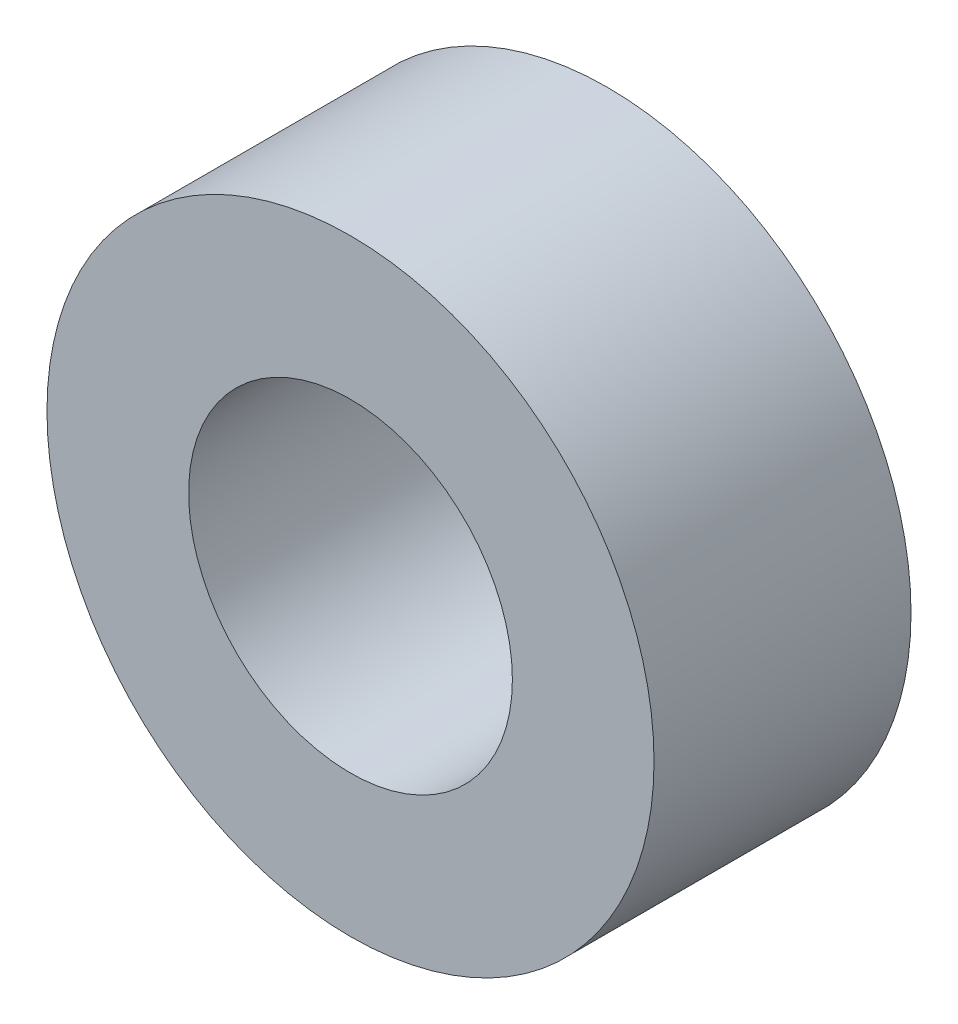
ISO-10303-21;
HEADER;
FILE_DESCRIPTION(('STEP AP214'),'2;1');
FILE_NAME('part.step','',(''),(''),'','','');
FILE_SCHEMA(('AUTOMOTIVE_DESIGN { 1 0 10303 214 1 1 1 1 }'));
ENDSEC;
DATA;
#1=APPLICATION_CONTEXT('core data for automotive mechanical design processes');
#2=APPLICATION_PROTOCOL_DEFINITION('international standard','automotive_design',2000,#1);
#3=PRODUCT_CONTEXT('',#1,'mechanical');
#4=PRODUCT('Part','Part','',(#3));
#5=PRODUCT_RELATED_PRODUCT_CATEGORY('part','',(#4));
#6=PRODUCT_DEFINITION_FORMATION('','',#4);
#7=PRODUCT_DEFINITION_CONTEXT('part definition',#1,'design');
#8=PRODUCT_DEFINITION('design','',#6,#7);
#9=PRODUCT_DEFINITION_SHAPE('','',#8);
#10=(LENGTH_UNIT() NAMED_UNIT(*) SI_UNIT(.MILLI.,.METRE.));
#11=(NAMED_UNIT(*) PLANE_ANGLE_UNIT() SI_UNIT($,.RADIAN.));
#12=(NAMED_UNIT(*) SI_UNIT($,.STERADIAN.) SOLID_ANGLE_UNIT());
#13=UNCERTAINTY_MEASURE_WITH_UNIT(LENGTH_MEASURE(1.E-05),#10,'distance_accuracy_value','');
#14=(GEOMETRIC_REPRESENTATION_CONTEXT(3) GLOBAL_UNCERTAINTY_ASSIGNED_CONTEXT((#13)) GLOBAL_UNIT_ASSIGNED_CONTEXT((#10,
#11,#12)) REPRESENTATION_CONTEXT('',''));
#15=CARTESIAN_POINT('',(0.,0.,0.));
#16=DIRECTION('',(0.,0.,1.));
#17=DIRECTION('',(1.,0.,0.));
#18=AXIS2_PLACEMENT_3D('',#15,#16,#17);
#19=CARTESIAN_POINT('',(0.,0.,3.175));
#20=DIRECTION('',(0.,0.,1.));
#21=DIRECTION('',(1.,0.,0.));
#22=AXIS2_PLACEMENT_3D('',#19,#20,#21);
#23=PLANE('',#22);
#24=CARTESIAN_POINT('',(0.,0.,3.175));
#25=DIRECTION('',(0.,0.,1.));
#26=DIRECTION('',(1.,0.,0.));
#27=AXIS2_PLACEMENT_3D('',#24,#25,#26);
#28=CIRCLE('',#27,3.75);
#29=CARTESIAN_POINT('',(3.75,0.,3.175));
#30=VERTEX_POINT('',#29);
#31=EDGE_CURVE('E10',#30,#30,#28,.T.);
#32=ORIENTED_EDGE('',*,*,#31,.T.);
#33=EDGE_LOOP('',(#32));
#34=FACE_BOUND('',#33,.T.);
#35=CARTESIAN_POINT('',(0.,0.,3.175));
#36=DIRECTION('',(0.,0.,1.));
#37=DIRECTION('',(1.,0.,0.));
#38=AXIS2_PLACEMENT_3D('',#35,#36,#37);
#39=CIRCLE('',#38,2.);
#40=CARTESIAN_POINT('',(2.,0.,3.175));
#41=VERTEX_POINT('',#40);
#42=EDGE_CURVE('E54',#41,#41,#39,.T.);
#43=ORIENTED_EDGE('',*,*,#42,.F.);
#44=EDGE_LOOP('',(#43));
#45=FACE_BOUND('',#44,.T.);
#46=ADVANCED_FACE('F41',(#34,#45),#23,.T.);
#47=CARTESIAN_POINT('',(0.,0.,0.));
#48=DIRECTION('',(0.,0.,1.));
#49=DIRECTION('',(1.,0.,0.));
#50=AXIS2_PLACEMENT_3D('',#47,#48,#49);
#51=PLANE('',#50);
#52=CARTESIAN_POINT('',(0.,0.,0.));
#53=DIRECTION('',(0.,0.,1.));
#54=DIRECTION('',(1.,0.,0.));
#55=AXIS2_PLACEMENT_3D('',#52,#53,#54);
#56=CIRCLE('',#55,3.75);
#57=CARTESIAN_POINT('',(3.75,0.,0.));
#58=VERTEX_POINT('',#57);
#59=EDGE_CURVE('E45',#58,#58,#56,.T.);
#60=ORIENTED_EDGE('',*,*,#59,.F.);
#61=EDGE_LOOP('',(#60));
#62=FACE_BOUND('',#61,.T.);
#63=CARTESIAN_POINT('',(0.,0.,0.));
#64=DIRECTION('',(0.,0.,1.));
#65=DIRECTION('',(1.,0.,0.));
#66=AXIS2_PLACEMENT_3D('',#63,#64,#65);
#67=CIRCLE('',#66,2.);
#68=CARTESIAN_POINT('',(2.,0.,0.));
#69=VERTEX_POINT('',#68);
#70=EDGE_CURVE('E56',#69,#69,#67,.T.);
#71=ORIENTED_EDGE('',*,*,#70,.T.);
#72=EDGE_LOOP('',(#71));
#73=FACE_BOUND('',#72,.T.);
#74=ADVANCED_FACE('F68',(#62,#73),#51,.F.);
#75=CARTESIAN_POINT('',(0.,0.,3.175));
#76=DIRECTION('',(0.,0.,-1.));
#77=DIRECTION('',(-1.,0.,0.));
#78=AXIS2_PLACEMENT_3D('',#75,#76,#77);
#79=CYLINDRICAL_SURFACE('',#78,3.75);
#80=ORIENTED_EDGE('',*,*,#31,.F.);
#81=EDGE_LOOP('',(#80));
#82=FACE_BOUND('',#81,.T.);
#83=ORIENTED_EDGE('',*,*,#59,.T.);
#84=EDGE_LOOP('',(#83));
#85=FACE_BOUND('',#84,.T.);
#86=ADVANCED_FACE('F43',(#82,#85),#79,.T.);
#87=CARTESIAN_POINT('',(0.,0.,3.175));
#88=DIRECTION('',(0.,0.,-1.));
#89=DIRECTION('',(-1.,0.,0.));
#90=AXIS2_PLACEMENT_3D('',#87,#88,#89);
#91=CYLINDRICAL_SURFACE('',#90,2.);
#92=ORIENTED_EDGE('',*,*,#42,.T.);
#93=EDGE_LOOP('',(#92));
#94=FACE_BOUND('',#93,.T.);
#95=ORIENTED_EDGE('',*,*,#70,.F.);
#96=EDGE_LOOP('',(#95));
#97=FACE_BOUND('',#96,.T.);
#98=ADVANCED_FACE('F64',(#94,#97),#91,.F.);
#99=CLOSED_SHELL('',(#46,#74,#86,#98));
#100=MANIFOLD_SOLID_BREP('B2',#99);
#101=ADVANCED_BREP_SHAPE_REPRESENTATION('',(#18,#100),#14);
#102=SHAPE_DEFINITION_REPRESENTATION(#9,#101);
ENDSEC;
END-ISO-10303-21;
